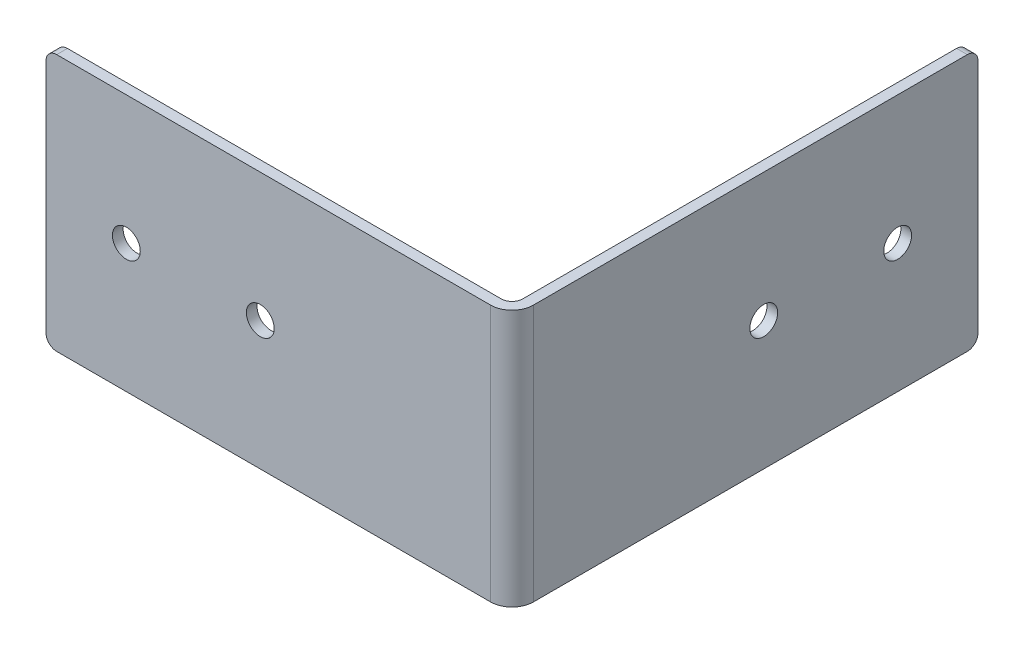
ISO-10303-21;
HEADER;
FILE_DESCRIPTION(('STEP AP214'),'2;1');
FILE_NAME('part.step','',(''),(''),'','','');
FILE_SCHEMA(('AUTOMOTIVE_DESIGN { 1 0 10303 214 1 1 1 1 }'));
ENDSEC;
DATA;
#1=APPLICATION_CONTEXT('core data for automotive mechanical design processes');
#2=APPLICATION_PROTOCOL_DEFINITION('international standard','automotive_design',2000,#1);
#3=PRODUCT_CONTEXT('',#1,'mechanical');
#4=PRODUCT('Part','Part','',(#3));
#5=PRODUCT_RELATED_PRODUCT_CATEGORY('part','',(#4));
#6=PRODUCT_DEFINITION_FORMATION('','',#4);
#7=PRODUCT_DEFINITION_CONTEXT('part definition',#1,'design');
#8=PRODUCT_DEFINITION('design','',#6,#7);
#9=PRODUCT_DEFINITION_SHAPE('','',#8);
#10=(LENGTH_UNIT() NAMED_UNIT(*) SI_UNIT(.MILLI.,.METRE.));
#11=(NAMED_UNIT(*) PLANE_ANGLE_UNIT() SI_UNIT($,.RADIAN.));
#12=(NAMED_UNIT(*) SI_UNIT($,.STERADIAN.) SOLID_ANGLE_UNIT());
#13=UNCERTAINTY_MEASURE_WITH_UNIT(LENGTH_MEASURE(1.E-05),#10,'distance_accuracy_value','');
#14=(GEOMETRIC_REPRESENTATION_CONTEXT(3) GLOBAL_UNCERTAINTY_ASSIGNED_CONTEXT((#13)) GLOBAL_UNIT_ASSIGNED_CONTEXT((#10,
#11,#12)) REPRESENTATION_CONTEXT('',''));
#15=CARTESIAN_POINT('',(0.,0.,0.));
#16=DIRECTION('',(0.,0.,1.));
#17=DIRECTION('',(1.,0.,0.));
#18=AXIS2_PLACEMENT_3D('',#15,#16,#17);
#19=CARTESIAN_POINT('',(1.579618788713E-13,0.,45.));
#20=DIRECTION('',(0.,0.,-1.));
#21=DIRECTION('',(-1.,0.,0.));
#22=AXIS2_PLACEMENT_3D('',#19,#20,#21);
#23=PLANE('',#22);
#24=DIRECTION('',(1.,0.,0.));
#25=VECTOR('',#24,1.);
#26=CARTESIAN_POINT('',(-85.,24.,45.0000000000003));
#27=LINE('',#26,#25);
#28=CARTESIAN_POINT('',(-83.,24.,45.0000000000003));
#29=VERTEX_POINT('',#28);
#30=CARTESIAN_POINT('',(-1.99999999999999,24.,45.0000000000001));
#31=VERTEX_POINT('',#30);
#32=EDGE_CURVE('E122',#29,#31,#27,.T.);
#33=ORIENTED_EDGE('',*,*,#32,.T.);
#34=DIRECTION('',(0.,1.,0.));
#35=VECTOR('',#34,1.);
#36=CARTESIAN_POINT('',(-1.99999999999999,24.,45.));
#37=LINE('',#36,#35);
#38=CARTESIAN_POINT('',(-1.99999999999999,-24.,45.));
#39=VERTEX_POINT('',#38);
#40=EDGE_CURVE('E128',#31,#39,#37,.F.);
#41=ORIENTED_EDGE('',*,*,#40,.T.);
#42=DIRECTION('',(1.,0.,0.));
#43=VECTOR('',#42,1.);
#44=CARTESIAN_POINT('',(0.,-24.,45.));
#45=LINE('',#44,#43);
#46=CARTESIAN_POINT('',(-83.,-24.,45.0000000000001));
#47=VERTEX_POINT('',#46);
#48=EDGE_CURVE('E113',#39,#47,#45,.F.);
#49=ORIENTED_EDGE('',*,*,#48,.T.);
#50=CARTESIAN_POINT('',(-83.,-22.,45.0000000000003));
#51=DIRECTION('',(0.,0.,-1.));
#52=DIRECTION('',(-1.,0.,0.));
#53=AXIS2_PLACEMENT_3D('',#50,#51,#52);
#54=CIRCLE('',#53,2.);
#55=CARTESIAN_POINT('',(-85.,-22.,45.0000000000003));
#56=VERTEX_POINT('',#55);
#57=EDGE_CURVE('E109',#56,#47,#54,.F.);
#58=ORIENTED_EDGE('',*,*,#57,.F.);
#59=DIRECTION('',(0.,1.,0.));
#60=VECTOR('',#59,1.);
#61=CARTESIAN_POINT('',(-85.,-24.,45.0000000000003));
#62=LINE('',#61,#60);
#63=CARTESIAN_POINT('',(-85.,22.,45.0000000000003));
#64=VERTEX_POINT('',#63);
#65=EDGE_CURVE('E106',#56,#64,#62,.T.);
#66=ORIENTED_EDGE('',*,*,#65,.T.);
#67=CARTESIAN_POINT('',(-83.,22.,45.0000000000003));
#68=DIRECTION('',(0.,0.,-1.));
#69=DIRECTION('',(-1.,0.,0.));
#70=AXIS2_PLACEMENT_3D('',#67,#68,#69);
#71=CIRCLE('',#70,2.);
#72=EDGE_CURVE('E93',#29,#64,#71,.F.);
#73=ORIENTED_EDGE('',*,*,#72,.F.);
#74=EDGE_LOOP('',(#33,#41,#49,#58,#66,#73));
#75=FACE_BOUND('',#74,.T.);
#76=CARTESIAN_POINT('',(-45.,0.,45.));
#77=DIRECTION('',(0.,0.,1.));
#78=DIRECTION('',(1.,0.,0.));
#79=AXIS2_PLACEMENT_3D('',#76,#77,#78);
#80=CIRCLE('',#79,2.6);
#81=CARTESIAN_POINT('',(-42.4,0.,45.));
#82=VERTEX_POINT('',#81);
#83=EDGE_CURVE('E103',#82,#82,#80,.T.);
#84=ORIENTED_EDGE('',*,*,#83,.T.);
#85=EDGE_LOOP('',(#84));
#86=FACE_BOUND('',#85,.T.);
#87=CARTESIAN_POINT('',(-70.,0.,45.));
#88=DIRECTION('',(0.,0.,1.));
#89=DIRECTION('',(1.,0.,0.));
#90=AXIS2_PLACEMENT_3D('',#87,#88,#89);
#91=CIRCLE('',#90,2.6);
#92=CARTESIAN_POINT('',(-67.4,0.,45.));
#93=VERTEX_POINT('',#92);
#94=EDGE_CURVE('E20',#93,#93,#91,.T.);
#95=ORIENTED_EDGE('',*,*,#94,.T.);
#96=EDGE_LOOP('',(#95));
#97=FACE_BOUND('',#96,.T.);
#98=ADVANCED_FACE('F17',(#75,#86,#97),#23,.T.);
#99=CARTESIAN_POINT('',(-70.,0.,45.));
#100=DIRECTION('',(0.,0.,1.));
#101=DIRECTION('',(1.,0.,0.));
#102=AXIS2_PLACEMENT_3D('',#99,#100,#101);
#103=CYLINDRICAL_SURFACE('',#102,2.6);
#104=ORIENTED_EDGE('',*,*,#94,.F.);
#105=EDGE_LOOP('',(#104));
#106=FACE_BOUND('',#105,.T.);
#107=CARTESIAN_POINT('',(-70.,0.,47.));
#108=DIRECTION('',(0.,0.,1.));
#109=DIRECTION('',(1.,0.,0.));
#110=AXIS2_PLACEMENT_3D('',#107,#108,#109);
#111=CIRCLE('',#110,2.6);
#112=CARTESIAN_POINT('',(-67.4,0.,47.));
#113=VERTEX_POINT('',#112);
#114=EDGE_CURVE('E177',#113,#113,#111,.T.);
#115=ORIENTED_EDGE('',*,*,#114,.T.);
#116=EDGE_LOOP('',(#115));
#117=FACE_BOUND('',#116,.T.);
#118=ADVANCED_FACE('F188',(#106,#117),#103,.F.);
#119=CARTESIAN_POINT('',(-45.,0.,45.));
#120=DIRECTION('',(0.,0.,1.));
#121=DIRECTION('',(1.,0.,0.));
#122=AXIS2_PLACEMENT_3D('',#119,#120,#121);
#123=CYLINDRICAL_SURFACE('',#122,2.6);
#124=ORIENTED_EDGE('',*,*,#83,.F.);
#125=EDGE_LOOP('',(#124));
#126=FACE_BOUND('',#125,.T.);
#127=CARTESIAN_POINT('',(-45.,0.,47.));
#128=DIRECTION('',(0.,0.,1.));
#129=DIRECTION('',(1.,0.,0.));
#130=AXIS2_PLACEMENT_3D('',#127,#128,#129);
#131=CIRCLE('',#130,2.6);
#132=CARTESIAN_POINT('',(-42.4,0.,47.));
#133=VERTEX_POINT('',#132);
#134=EDGE_CURVE('E174',#133,#133,#131,.T.);
#135=ORIENTED_EDGE('',*,*,#134,.T.);
#136=EDGE_LOOP('',(#135));
#137=FACE_BOUND('',#136,.T.);
#138=ADVANCED_FACE('F191',(#126,#137),#123,.F.);
#139=CARTESIAN_POINT('',(-83.,22.,47.0000000000003));
#140=DIRECTION('',(0.,0.,-1.));
#141=DIRECTION('',(-1.,0.,0.));
#142=AXIS2_PLACEMENT_3D('',#139,#140,#141);
#143=CYLINDRICAL_SURFACE('',#142,2.);
#144=ORIENTED_EDGE('',*,*,#72,.T.);
#145=DIRECTION('',(0.,0.,-1.));
#146=VECTOR('',#145,1.);
#147=CARTESIAN_POINT('',(-85.,22.,47.0000000000003));
#148=LINE('',#147,#146);
#149=CARTESIAN_POINT('',(-85.,22.,47.0000000000003));
#150=VERTEX_POINT('',#149);
#151=EDGE_CURVE('E98',#64,#150,#148,.F.);
#152=ORIENTED_EDGE('',*,*,#151,.T.);
#153=CARTESIAN_POINT('',(-83.,22.,47.0000000000003));
#154=DIRECTION('',(0.,0.,-1.));
#155=DIRECTION('',(-1.,0.,0.));
#156=AXIS2_PLACEMENT_3D('',#153,#154,#155);
#157=CIRCLE('',#156,2.);
#158=CARTESIAN_POINT('',(-83.,24.,47.0000000000003));
#159=VERTEX_POINT('',#158);
#160=EDGE_CURVE('E171',#150,#159,#157,.T.);
#161=ORIENTED_EDGE('',*,*,#160,.T.);
#162=DIRECTION('',(0.,0.,-1.));
#163=VECTOR('',#162,1.);
#164=CARTESIAN_POINT('',(-83.,24.,47.0000000000003));
#165=LINE('',#164,#163);
#166=EDGE_CURVE('E101',#159,#29,#165,.T.);
#167=ORIENTED_EDGE('',*,*,#166,.T.);
#168=EDGE_LOOP('',(#144,#152,#161,#167));
#169=FACE_BOUND('',#168,.T.);
#170=ADVANCED_FACE('F96',(#169),#143,.T.);
#171=CARTESIAN_POINT('',(-83.,-22.,47.0000000000003));
#172=DIRECTION('',(0.,0.,-1.));
#173=DIRECTION('',(-1.,0.,0.));
#174=AXIS2_PLACEMENT_3D('',#171,#172,#173);
#175=CYLINDRICAL_SURFACE('',#174,2.);
#176=ORIENTED_EDGE('',*,*,#57,.T.);
#177=DIRECTION('',(0.,0.,1.));
#178=VECTOR('',#177,1.);
#179=CARTESIAN_POINT('',(-83.,-24.,47.));
#180=LINE('',#179,#178);
#181=CARTESIAN_POINT('',(-83.,-24.,47.0000000000003));
#182=VERTEX_POINT('',#181);
#183=EDGE_CURVE('E126',#47,#182,#180,.T.);
#184=ORIENTED_EDGE('',*,*,#183,.T.);
#185=CARTESIAN_POINT('',(-83.,-22.,47.0000000000003));
#186=DIRECTION('',(0.,0.,-1.));
#187=DIRECTION('',(-1.,0.,0.));
#188=AXIS2_PLACEMENT_3D('',#185,#186,#187);
#189=CIRCLE('',#188,2.);
#190=CARTESIAN_POINT('',(-85.,-22.,47.0000000000003));
#191=VERTEX_POINT('',#190);
#192=EDGE_CURVE('E168',#182,#191,#189,.T.);
#193=ORIENTED_EDGE('',*,*,#192,.T.);
#194=DIRECTION('',(0.,0.,-1.));
#195=VECTOR('',#194,1.);
#196=CARTESIAN_POINT('',(-85.,-22.,47.0000000000003));
#197=LINE('',#196,#195);
#198=EDGE_CURVE('E114',#191,#56,#197,.T.);
#199=ORIENTED_EDGE('',*,*,#198,.T.);
#200=EDGE_LOOP('',(#176,#184,#193,#199));
#201=FACE_BOUND('',#200,.T.);
#202=ADVANCED_FACE('F338',(#201),#175,.T.);
#203=CARTESIAN_POINT('',(-85.,-24.,47.0000000000003));
#204=DIRECTION('',(1.,0.,0.));
#205=DIRECTION('',(0.,0.,-1.));
#206=AXIS2_PLACEMENT_3D('',#203,#204,#205);
#207=PLANE('',#206);
#208=ORIENTED_EDGE('',*,*,#198,.F.);
#209=DIRECTION('',(0.,1.,0.));
#210=VECTOR('',#209,1.);
#211=CARTESIAN_POINT('',(-85.,0.,47.0000000000003));
#212=LINE('',#211,#210);
#213=EDGE_CURVE('E118',#191,#150,#212,.T.);
#214=ORIENTED_EDGE('',*,*,#213,.T.);
#215=ORIENTED_EDGE('',*,*,#151,.F.);
#216=ORIENTED_EDGE('',*,*,#65,.F.);
#217=EDGE_LOOP('',(#208,#214,#215,#216));
#218=FACE_BOUND('',#217,.T.);
#219=ADVANCED_FACE('F116',(#218),#207,.F.);
#220=CARTESIAN_POINT('',(-1.99999999999999,24.,43.));
#221=DIRECTION('',(0.,1.,0.));
#222=DIRECTION('',(0.,0.,1.));
#223=AXIS2_PLACEMENT_3D('',#220,#221,#222);
#224=CYLINDRICAL_SURFACE('',#223,1.99999999999999);
#225=CARTESIAN_POINT('',(-1.99999999999999,-24.,43.));
#226=DIRECTION('',(0.,1.,0.));
#227=DIRECTION('',(0.,0.,1.));
#228=AXIS2_PLACEMENT_3D('',#225,#226,#227);
#229=CIRCLE('',#228,1.99999999999999);
#230=CARTESIAN_POINT('',(0.,-24.,43.));
#231=VERTEX_POINT('',#230);
#232=EDGE_CURVE('E165',#39,#231,#229,.T.);
#233=ORIENTED_EDGE('',*,*,#232,.F.);
#234=ORIENTED_EDGE('',*,*,#40,.F.);
#235=CARTESIAN_POINT('',(-1.99999999999999,24.,43.));
#236=DIRECTION('',(0.,1.,0.));
#237=DIRECTION('',(0.,0.,1.));
#238=AXIS2_PLACEMENT_3D('',#235,#236,#237);
#239=CIRCLE('',#238,1.99999999999999);
#240=CARTESIAN_POINT('',(0.,24.,43.));
#241=VERTEX_POINT('',#240);
#242=EDGE_CURVE('E180',#31,#241,#239,.T.);
#243=ORIENTED_EDGE('',*,*,#242,.T.);
#244=DIRECTION('',(0.,1.,0.));
#245=VECTOR('',#244,1.);
#246=CARTESIAN_POINT('',(0.,0.,43.));
#247=LINE('',#246,#245);
#248=EDGE_CURVE('E181',#241,#231,#247,.F.);
#249=ORIENTED_EDGE('',*,*,#248,.T.);
#250=EDGE_LOOP('',(#233,#234,#243,#249));
#251=FACE_BOUND('',#250,.T.);
#252=ADVANCED_FACE('F208',(#251),#224,.F.);
#253=CARTESIAN_POINT('',(0.,0.,0.));
#254=DIRECTION('',(1.,0.,0.));
#255=DIRECTION('',(0.,0.,-1.));
#256=AXIS2_PLACEMENT_3D('',#253,#254,#255);
#257=PLANE('',#256);
#258=CARTESIAN_POINT('',(0.,-22.,-38.));
#259=DIRECTION('',(1.,0.,0.));
#260=DIRECTION('',(0.,0.,-1.));
#261=AXIS2_PLACEMENT_3D('',#258,#259,#260);
#262=CIRCLE('',#261,2.);
#263=CARTESIAN_POINT('',(0.,-24.,-38.));
#264=VERTEX_POINT('',#263);
#265=CARTESIAN_POINT('',(0.,-22.,-40.));
#266=VERTEX_POINT('',#265);
#267=EDGE_CURVE('E155',#264,#266,#262,.T.);
#268=ORIENTED_EDGE('',*,*,#267,.F.);
#269=DIRECTION('',(0.,0.,-1.));
#270=VECTOR('',#269,1.);
#271=CARTESIAN_POINT('',(0.,-24.,45.));
#272=LINE('',#271,#270);
#273=EDGE_CURVE('E158',#231,#264,#272,.T.);
#274=ORIENTED_EDGE('',*,*,#273,.F.);
#275=ORIENTED_EDGE('',*,*,#248,.F.);
#276=DIRECTION('',(0.,0.,1.));
#277=VECTOR('',#276,1.);
#278=CARTESIAN_POINT('',(0.,24.,45.));
#279=LINE('',#278,#277);
#280=CARTESIAN_POINT('',(0.,24.,-38.));
#281=VERTEX_POINT('',#280);
#282=EDGE_CURVE('E150',#281,#241,#279,.T.);
#283=ORIENTED_EDGE('',*,*,#282,.F.);
#284=CARTESIAN_POINT('',(0.,22.,-38.));
#285=DIRECTION('',(1.,0.,0.));
#286=DIRECTION('',(0.,0.,-1.));
#287=AXIS2_PLACEMENT_3D('',#284,#285,#286);
#288=CIRCLE('',#287,2.);
#289=CARTESIAN_POINT('',(0.,22.,-40.));
#290=VERTEX_POINT('',#289);
#291=EDGE_CURVE('E151',#290,#281,#288,.T.);
#292=ORIENTED_EDGE('',*,*,#291,.F.);
#293=DIRECTION('',(0.,1.,0.));
#294=VECTOR('',#293,1.);
#295=CARTESIAN_POINT('',(0.,-24.,-40.));
#296=LINE('',#295,#294);
#297=EDGE_CURVE('E154',#266,#290,#296,.T.);
#298=ORIENTED_EDGE('',*,*,#297,.F.);
#299=EDGE_LOOP('',(#268,#274,#275,#283,#292,#298));
#300=FACE_BOUND('',#299,.T.);
#301=CARTESIAN_POINT('',(0.,0.,0.));
#302=DIRECTION('',(1.,0.,0.));
#303=DIRECTION('',(0.,0.,-1.));
#304=AXIS2_PLACEMENT_3D('',#301,#302,#303);
#305=CIRCLE('',#304,2.6);
#306=CARTESIAN_POINT('',(0.,0.,-2.6));
#307=VERTEX_POINT('',#306);
#308=EDGE_CURVE('E162',#307,#307,#305,.T.);
#309=ORIENTED_EDGE('',*,*,#308,.T.);
#310=EDGE_LOOP('',(#309));
#311=FACE_BOUND('',#310,.T.);
#312=CARTESIAN_POINT('',(0.,0.,-25.));
#313=DIRECTION('',(1.,0.,0.));
#314=DIRECTION('',(0.,0.,-1.));
#315=AXIS2_PLACEMENT_3D('',#312,#313,#314);
#316=CIRCLE('',#315,2.6);
#317=CARTESIAN_POINT('',(0.,0.,-27.6));
#318=VERTEX_POINT('',#317);
#319=EDGE_CURVE('E159',#318,#318,#316,.T.);
#320=ORIENTED_EDGE('',*,*,#319,.T.);
#321=EDGE_LOOP('',(#320));
#322=FACE_BOUND('',#321,.T.);
#323=ADVANCED_FACE('F197',(#300,#311,#322),#257,.F.);
#324=CARTESIAN_POINT('',(1.64944841548986E-13,0.,47.));
#325=DIRECTION('',(0.,0.,-1.));
#326=DIRECTION('',(-1.,0.,0.));
#327=AXIS2_PLACEMENT_3D('',#324,#325,#326);
#328=PLANE('',#327);
#329=ORIENTED_EDGE('',*,*,#192,.F.);
#330=DIRECTION('',(-1.,0.,0.));
#331=VECTOR('',#330,1.);
#332=CARTESIAN_POINT('',(1.64944841548986E-13,-24.,47.));
#333=LINE('',#332,#331);
#334=CARTESIAN_POINT('',(-1.99999999999999,-24.,47.));
#335=VERTEX_POINT('',#334);
#336=EDGE_CURVE('E170',#335,#182,#333,.T.);
#337=ORIENTED_EDGE('',*,*,#336,.F.);
#338=DIRECTION('',(0.,1.,0.));
#339=VECTOR('',#338,1.);
#340=CARTESIAN_POINT('',(-1.99999999999999,24.,47.));
#341=LINE('',#340,#339);
#342=CARTESIAN_POINT('',(-1.99999999999999,24.,47.));
#343=VERTEX_POINT('',#342);
#344=EDGE_CURVE('E148',#343,#335,#341,.F.);
#345=ORIENTED_EDGE('',*,*,#344,.F.);
#346=DIRECTION('',(-1.,0.,0.));
#347=VECTOR('',#346,1.);
#348=CARTESIAN_POINT('',(1.64944841548986E-13,24.,47.));
#349=LINE('',#348,#347);
#350=EDGE_CURVE('E173',#159,#343,#349,.F.);
#351=ORIENTED_EDGE('',*,*,#350,.F.);
#352=ORIENTED_EDGE('',*,*,#160,.F.);
#353=ORIENTED_EDGE('',*,*,#213,.F.);
#354=EDGE_LOOP('',(#329,#337,#345,#351,#352,#353));
#355=FACE_BOUND('',#354,.T.);
#356=ORIENTED_EDGE('',*,*,#134,.F.);
#357=EDGE_LOOP('',(#356));
#358=FACE_BOUND('',#357,.T.);
#359=ORIENTED_EDGE('',*,*,#114,.F.);
#360=EDGE_LOOP('',(#359));
#361=FACE_BOUND('',#360,.T.);
#362=ADVANCED_FACE('F194',(#355,#358,#361),#328,.F.);
#363=CARTESIAN_POINT('',(2.,0.,0.));
#364=DIRECTION('',(1.,0.,0.));
#365=DIRECTION('',(0.,0.,-1.));
#366=AXIS2_PLACEMENT_3D('',#363,#364,#365);
#367=CYLINDRICAL_SURFACE('',#366,2.6);
#368=CARTESIAN_POINT('',(2.,0.,0.));
#369=DIRECTION('',(1.,0.,0.));
#370=DIRECTION('',(0.,0.,-1.));
#371=AXIS2_PLACEMENT_3D('',#368,#369,#370);
#372=CIRCLE('',#371,2.6);
#373=CARTESIAN_POINT('',(2.,0.,-2.6));
#374=VERTEX_POINT('',#373);
#375=EDGE_CURVE('E142',#374,#374,#372,.F.);
#376=ORIENTED_EDGE('',*,*,#375,.F.);
#377=EDGE_LOOP('',(#376));
#378=FACE_BOUND('',#377,.T.);
#379=ORIENTED_EDGE('',*,*,#308,.F.);
#380=EDGE_LOOP('',(#379));
#381=FACE_BOUND('',#380,.T.);
#382=ADVANCED_FACE('F196',(#378,#381),#367,.F.);
#383=CARTESIAN_POINT('',(2.,0.,-25.));
#384=DIRECTION('',(1.,0.,0.));
#385=DIRECTION('',(0.,0.,-1.));
#386=AXIS2_PLACEMENT_3D('',#383,#384,#385);
#387=CYLINDRICAL_SURFACE('',#386,2.6);
#388=CARTESIAN_POINT('',(2.,0.,-25.));
#389=DIRECTION('',(1.,0.,0.));
#390=DIRECTION('',(0.,0.,-1.));
#391=AXIS2_PLACEMENT_3D('',#388,#389,#390);
#392=CIRCLE('',#391,2.6);
#393=CARTESIAN_POINT('',(2.,0.,-27.6));
#394=VERTEX_POINT('',#393);
#395=EDGE_CURVE('E139',#394,#394,#392,.F.);
#396=ORIENTED_EDGE('',*,*,#395,.F.);
#397=EDGE_LOOP('',(#396));
#398=FACE_BOUND('',#397,.T.);
#399=ORIENTED_EDGE('',*,*,#319,.F.);
#400=EDGE_LOOP('',(#399));
#401=FACE_BOUND('',#400,.T.);
#402=ADVANCED_FACE('F205',(#398,#401),#387,.F.);
#403=CARTESIAN_POINT('',(2.,-24.,45.));
#404=DIRECTION('',(0.,-1.,0.));
#405=DIRECTION('',(0.,0.,-1.));
#406=AXIS2_PLACEMENT_3D('',#403,#404,#405);
#407=PLANE('',#406);
#408=DIRECTION('',(0.,0.,-1.));
#409=VECTOR('',#408,1.);
#410=CARTESIAN_POINT('',(2.,-24.,0.));
#411=LINE('',#410,#409);
#412=CARTESIAN_POINT('',(2.,-24.,43.));
#413=VERTEX_POINT('',#412);
#414=CARTESIAN_POINT('',(2.,-24.,-38.));
#415=VERTEX_POINT('',#414);
#416=EDGE_CURVE('E138',#413,#415,#411,.T.);
#417=ORIENTED_EDGE('',*,*,#416,.F.);
#418=CARTESIAN_POINT('',(-1.99999999999999,-24.,43.));
#419=DIRECTION('',(0.,1.,0.));
#420=DIRECTION('',(0.,0.,1.));
#421=AXIS2_PLACEMENT_3D('',#418,#419,#420);
#422=CIRCLE('',#421,4.);
#423=EDGE_CURVE('E145',#335,#413,#422,.T.);
#424=ORIENTED_EDGE('',*,*,#423,.F.);
#425=ORIENTED_EDGE('',*,*,#336,.T.);
#426=ORIENTED_EDGE('',*,*,#183,.F.);
#427=ORIENTED_EDGE('',*,*,#48,.F.);
#428=ORIENTED_EDGE('',*,*,#232,.T.);
#429=ORIENTED_EDGE('',*,*,#273,.T.);
#430=DIRECTION('',(1.,0.,0.));
#431=VECTOR('',#430,1.);
#432=CARTESIAN_POINT('',(2.,-24.,-38.));
#433=LINE('',#432,#431);
#434=EDGE_CURVE('E157',#415,#264,#433,.F.);
#435=ORIENTED_EDGE('',*,*,#434,.F.);
#436=EDGE_LOOP('',(#417,#424,#425,#426,#427,#428,#429,#435));
#437=FACE_BOUND('',#436,.T.);
#438=ADVANCED_FACE('F240',(#437),#407,.T.);
#439=CARTESIAN_POINT('',(2.,-22.,-38.));
#440=DIRECTION('',(1.,0.,0.));
#441=DIRECTION('',(0.,0.,-1.));
#442=AXIS2_PLACEMENT_3D('',#439,#440,#441);
#443=CYLINDRICAL_SURFACE('',#442,2.);
#444=CARTESIAN_POINT('',(2.,-22.,-38.));
#445=DIRECTION('',(1.,0.,0.));
#446=DIRECTION('',(0.,0.,-1.));
#447=AXIS2_PLACEMENT_3D('',#444,#445,#446);
#448=CIRCLE('',#447,2.);
#449=CARTESIAN_POINT('',(2.,-22.,-40.));
#450=VERTEX_POINT('',#449);
#451=EDGE_CURVE('E135',#415,#450,#448,.T.);
#452=ORIENTED_EDGE('',*,*,#451,.F.);
#453=ORIENTED_EDGE('',*,*,#434,.T.);
#454=ORIENTED_EDGE('',*,*,#267,.T.);
#455=DIRECTION('',(1.,0.,0.));
#456=VECTOR('',#455,1.);
#457=CARTESIAN_POINT('',(2.,-22.,-40.));
#458=LINE('',#457,#456);
#459=EDGE_CURVE('E411',#450,#266,#458,.F.);
#460=ORIENTED_EDGE('',*,*,#459,.F.);
#461=EDGE_LOOP('',(#452,#453,#454,#460));
#462=FACE_BOUND('',#461,.T.);
#463=ADVANCED_FACE('F236',(#462),#443,.T.);
#464=CARTESIAN_POINT('',(2.,-24.,-40.));
#465=DIRECTION('',(0.,0.,-1.));
#466=DIRECTION('',(0.,1.,0.));
#467=AXIS2_PLACEMENT_3D('',#464,#465,#466);
#468=PLANE('',#467);
#469=ORIENTED_EDGE('',*,*,#297,.T.);
#470=DIRECTION('',(1.,0.,0.));
#471=VECTOR('',#470,1.);
#472=CARTESIAN_POINT('',(2.,22.,-40.));
#473=LINE('',#472,#471);
#474=CARTESIAN_POINT('',(2.,22.,-40.));
#475=VERTEX_POINT('',#474);
#476=EDGE_CURVE('E153',#475,#290,#473,.F.);
#477=ORIENTED_EDGE('',*,*,#476,.F.);
#478=DIRECTION('',(0.,1.,0.));
#479=VECTOR('',#478,1.);
#480=CARTESIAN_POINT('',(2.,0.,-40.));
#481=LINE('',#480,#479);
#482=EDGE_CURVE('E134',#450,#475,#481,.T.);
#483=ORIENTED_EDGE('',*,*,#482,.F.);
#484=ORIENTED_EDGE('',*,*,#459,.T.);
#485=EDGE_LOOP('',(#469,#477,#483,#484));
#486=FACE_BOUND('',#485,.T.);
#487=ADVANCED_FACE('F232',(#486),#468,.T.);
#488=CARTESIAN_POINT('',(2.,22.,-38.));
#489=DIRECTION('',(1.,0.,0.));
#490=DIRECTION('',(0.,0.,-1.));
#491=AXIS2_PLACEMENT_3D('',#488,#489,#490);
#492=CYLINDRICAL_SURFACE('',#491,2.);
#493=CARTESIAN_POINT('',(2.,22.,-38.));
#494=DIRECTION('',(1.,0.,0.));
#495=DIRECTION('',(0.,0.,-1.));
#496=AXIS2_PLACEMENT_3D('',#493,#494,#495);
#497=CIRCLE('',#496,2.);
#498=CARTESIAN_POINT('',(2.,24.,-38.));
#499=VERTEX_POINT('',#498);
#500=EDGE_CURVE('E131',#475,#499,#497,.T.);
#501=ORIENTED_EDGE('',*,*,#500,.F.);
#502=ORIENTED_EDGE('',*,*,#476,.T.);
#503=ORIENTED_EDGE('',*,*,#291,.T.);
#504=DIRECTION('',(1.,0.,0.));
#505=VECTOR('',#504,1.);
#506=CARTESIAN_POINT('',(2.,24.,-38.));
#507=LINE('',#506,#505);
#508=EDGE_CURVE('E407',#499,#281,#507,.F.);
#509=ORIENTED_EDGE('',*,*,#508,.F.);
#510=EDGE_LOOP('',(#501,#502,#503,#509));
#511=FACE_BOUND('',#510,.T.);
#512=ADVANCED_FACE('F229',(#511),#492,.T.);
#513=CARTESIAN_POINT('',(2.,24.,45.));
#514=DIRECTION('',(0.,1.,0.));
#515=DIRECTION('',(0.,0.,1.));
#516=AXIS2_PLACEMENT_3D('',#513,#514,#515);
#517=PLANE('',#516);
#518=ORIENTED_EDGE('',*,*,#282,.T.);
#519=ORIENTED_EDGE('',*,*,#242,.F.);
#520=ORIENTED_EDGE('',*,*,#32,.F.);
#521=ORIENTED_EDGE('',*,*,#166,.F.);
#522=ORIENTED_EDGE('',*,*,#350,.T.);
#523=CARTESIAN_POINT('',(-1.99999999999999,24.,43.));
#524=DIRECTION('',(0.,1.,0.));
#525=DIRECTION('',(0.,0.,1.));
#526=AXIS2_PLACEMENT_3D('',#523,#524,#525);
#527=CIRCLE('',#526,4.);
#528=CARTESIAN_POINT('',(2.,24.,43.));
#529=VERTEX_POINT('',#528);
#530=EDGE_CURVE('E35',#529,#343,#527,.F.);
#531=ORIENTED_EDGE('',*,*,#530,.F.);
#532=DIRECTION('',(0.,0.,-1.));
#533=VECTOR('',#532,1.);
#534=CARTESIAN_POINT('',(2.,24.,0.));
#535=LINE('',#534,#533);
#536=EDGE_CURVE('E26',#499,#529,#535,.F.);
#537=ORIENTED_EDGE('',*,*,#536,.F.);
#538=ORIENTED_EDGE('',*,*,#508,.T.);
#539=EDGE_LOOP('',(#518,#519,#520,#521,#522,#531,#537,#538));
#540=FACE_BOUND('',#539,.T.);
#541=ADVANCED_FACE('F221',(#540),#517,.T.);
#542=CARTESIAN_POINT('',(-1.99999999999999,24.,43.));
#543=DIRECTION('',(0.,1.,0.));
#544=DIRECTION('',(0.,0.,1.));
#545=AXIS2_PLACEMENT_3D('',#542,#543,#544);
#546=CYLINDRICAL_SURFACE('',#545,4.);
#547=ORIENTED_EDGE('',*,*,#344,.T.);
#548=ORIENTED_EDGE('',*,*,#423,.T.);
#549=DIRECTION('',(0.,1.,0.));
#550=VECTOR('',#549,1.);
#551=CARTESIAN_POINT('',(2.,0.,43.));
#552=LINE('',#551,#550);
#553=EDGE_CURVE('E11',#529,#413,#552,.F.);
#554=ORIENTED_EDGE('',*,*,#553,.F.);
#555=ORIENTED_EDGE('',*,*,#530,.T.);
#556=EDGE_LOOP('',(#547,#548,#554,#555));
#557=FACE_BOUND('',#556,.T.);
#558=ADVANCED_FACE('F215',(#557),#546,.T.);
#559=CARTESIAN_POINT('',(2.,0.,0.));
#560=DIRECTION('',(1.,0.,0.));
#561=DIRECTION('',(0.,0.,-1.));
#562=AXIS2_PLACEMENT_3D('',#559,#560,#561);
#563=PLANE('',#562);
#564=ORIENTED_EDGE('',*,*,#536,.T.);
#565=ORIENTED_EDGE('',*,*,#553,.T.);
#566=ORIENTED_EDGE('',*,*,#416,.T.);
#567=ORIENTED_EDGE('',*,*,#451,.T.);
#568=ORIENTED_EDGE('',*,*,#482,.T.);
#569=ORIENTED_EDGE('',*,*,#500,.T.);
#570=EDGE_LOOP('',(#564,#565,#566,#567,#568,#569));
#571=FACE_BOUND('',#570,.T.);
#572=ORIENTED_EDGE('',*,*,#395,.T.);
#573=EDGE_LOOP('',(#572));
#574=FACE_BOUND('',#573,.T.);
#575=ORIENTED_EDGE('',*,*,#375,.T.);
#576=EDGE_LOOP('',(#575));
#577=FACE_BOUND('',#576,.T.);
#578=ADVANCED_FACE('F213',(#571,#574,#577),#563,.T.);
#579=CLOSED_SHELL('',(#98,#118,#138,#170,#202,#219,#252,#323,#362,#382,#402,#438,#463,#487,#512,
#541,#558,#578));
#580=MANIFOLD_SOLID_BREP('B1',#579);
#581=ADVANCED_BREP_SHAPE_REPRESENTATION('',(#18,#580),#14);
#582=SHAPE_DEFINITION_REPRESENTATION(#9,#581);
ENDSEC;
END-ISO-10303-21;
